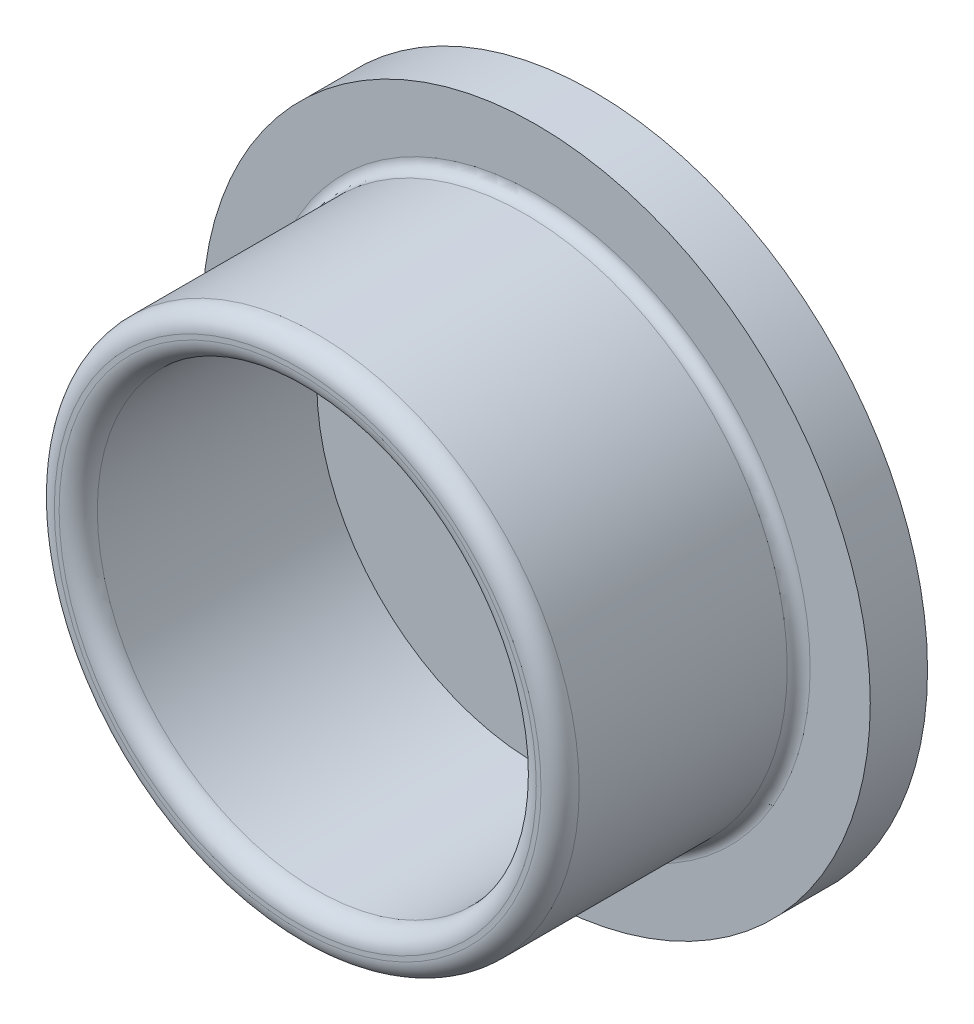
ISO-10303-21;
HEADER;
FILE_DESCRIPTION(('STEP AP214'),'2;1');
FILE_NAME('part.step','',(''),(''),'','','');
FILE_SCHEMA(('AUTOMOTIVE_DESIGN { 1 0 10303 214 1 1 1 1 }'));
ENDSEC;
DATA;
#1=APPLICATION_CONTEXT('core data for automotive mechanical design processes');
#2=APPLICATION_PROTOCOL_DEFINITION('international standard','automotive_design',2000,#1);
#3=PRODUCT_CONTEXT('',#1,'mechanical');
#4=PRODUCT('Part','Part','',(#3));
#5=PRODUCT_RELATED_PRODUCT_CATEGORY('part','',(#4));
#6=PRODUCT_DEFINITION_FORMATION('','',#4);
#7=PRODUCT_DEFINITION_CONTEXT('part definition',#1,'design');
#8=PRODUCT_DEFINITION('design','',#6,#7);
#9=PRODUCT_DEFINITION_SHAPE('','',#8);
#10=(LENGTH_UNIT() NAMED_UNIT(*) SI_UNIT(.MILLI.,.METRE.));
#11=(NAMED_UNIT(*) PLANE_ANGLE_UNIT() SI_UNIT($,.RADIAN.));
#12=(NAMED_UNIT(*) SI_UNIT($,.STERADIAN.) SOLID_ANGLE_UNIT());
#13=UNCERTAINTY_MEASURE_WITH_UNIT(LENGTH_MEASURE(1.E-05),#10,'distance_accuracy_value','');
#14=(GEOMETRIC_REPRESENTATION_CONTEXT(3) GLOBAL_UNCERTAINTY_ASSIGNED_CONTEXT((#13)) GLOBAL_UNIT_ASSIGNED_CONTEXT((#10,
#11,#12)) REPRESENTATION_CONTEXT('',''));
#15=CARTESIAN_POINT('',(0.,0.,0.));
#16=DIRECTION('',(0.,0.,1.));
#17=DIRECTION('',(1.,0.,0.));
#18=AXIS2_PLACEMENT_3D('',#15,#16,#17);
#19=CARTESIAN_POINT('',(0.,0.,3.1));
#20=DIRECTION('',(0.,0.,1.));
#21=DIRECTION('',(1.,0.,0.));
#22=AXIS2_PLACEMENT_3D('',#19,#20,#21);
#23=PLANE('',#22);
#24=CARTESIAN_POINT('',(0.,0.,3.1));
#25=DIRECTION('',(0.,0.,1.));
#26=DIRECTION('',(1.,0.,0.));
#27=AXIS2_PLACEMENT_3D('',#24,#25,#26);
#28=CIRCLE('',#27,2.5);
#29=CARTESIAN_POINT('',(2.5,0.,3.1));
#30=VERTEX_POINT('',#29);
#31=CARTESIAN_POINT('',(-2.5,0.,3.1));
#32=VERTEX_POINT('',#31);
#33=EDGE_CURVE('E59',#30,#32,#28,.T.);
#34=ORIENTED_EDGE('',*,*,#33,.F.);
#35=CARTESIAN_POINT('',(0.,0.,3.1));
#36=DIRECTION('',(0.,0.,1.));
#37=DIRECTION('',(-1.,0.,0.));
#38=AXIS2_PLACEMENT_3D('',#35,#36,#37);
#39=CIRCLE('',#38,2.5);
#40=EDGE_CURVE('E96',#32,#30,#39,.T.);
#41=ORIENTED_EDGE('',*,*,#40,.F.);
#42=EDGE_LOOP('',(#34,#41));
#43=FACE_BOUND('',#42,.T.);
#44=CARTESIAN_POINT('',(0.,0.,3.1));
#45=DIRECTION('',(0.,0.,-1.));
#46=DIRECTION('',(-1.,0.,0.));
#47=AXIS2_PLACEMENT_3D('',#44,#45,#46);
#48=CIRCLE('',#47,2.55);
#49=CARTESIAN_POINT('',(-2.55,0.,3.1));
#50=VERTEX_POINT('',#49);
#51=CARTESIAN_POINT('',(2.55,0.,3.1));
#52=VERTEX_POINT('',#51);
#53=EDGE_CURVE('E51',#50,#52,#48,.T.);
#54=ORIENTED_EDGE('',*,*,#53,.F.);
#55=CARTESIAN_POINT('',(0.,0.,3.1));
#56=DIRECTION('',(0.,0.,-1.));
#57=DIRECTION('',(1.,0.,0.));
#58=AXIS2_PLACEMENT_3D('',#55,#56,#57);
#59=CIRCLE('',#58,2.55);
#60=EDGE_CURVE('E53',#52,#50,#59,.T.);
#61=ORIENTED_EDGE('',*,*,#60,.F.);
#62=EDGE_LOOP('',(#54,#61));
#63=FACE_BOUND('',#62,.T.);
#64=ADVANCED_FACE('F17',(#43,#63),#23,.T.);
#65=CARTESIAN_POINT('',(0.,0.,2.9));
#66=DIRECTION('',(0.,0.,1.));
#67=DIRECTION('',(1.,0.,0.));
#68=AXIS2_PLACEMENT_3D('',#65,#66,#67);
#69=TOROIDAL_SURFACE('',#68,2.55,0.2);
#70=ORIENTED_EDGE('',*,*,#53,.T.);
#71=ORIENTED_EDGE('',*,*,#60,.T.);
#72=EDGE_LOOP('',(#70,#71));
#73=FACE_BOUND('',#72,.T.);
#74=CARTESIAN_POINT('',(0.,0.,2.9));
#75=DIRECTION('',(0.,0.,1.));
#76=DIRECTION('',(1.,0.,0.));
#77=AXIS2_PLACEMENT_3D('',#74,#75,#76);
#78=CIRCLE('',#77,2.75);
#79=CARTESIAN_POINT('',(2.75,0.,2.9));
#80=VERTEX_POINT('',#79);
#81=EDGE_CURVE('E128',#80,#80,#78,.F.);
#82=ORIENTED_EDGE('',*,*,#81,.F.);
#83=EDGE_LOOP('',(#82));
#84=FACE_BOUND('',#83,.T.);
#85=ADVANCED_FACE('F55',(#73,#84),#69,.T.);
#86=CARTESIAN_POINT('',(0.,0.,2.9));
#87=DIRECTION('',(0.,0.,1.));
#88=DIRECTION('',(1.,0.,0.));
#89=AXIS2_PLACEMENT_3D('',#86,#87,#88);
#90=TOROIDAL_SURFACE('',#89,2.5,0.2);
#91=CARTESIAN_POINT('',(0.,0.,2.9));
#92=DIRECTION('',(0.,0.,1.));
#93=DIRECTION('',(1.,0.,0.));
#94=AXIS2_PLACEMENT_3D('',#91,#92,#93);
#95=CIRCLE('',#94,2.3);
#96=CARTESIAN_POINT('',(2.3,0.,2.9));
#97=VERTEX_POINT('',#96);
#98=EDGE_CURVE('E126',#97,#97,#95,.F.);
#99=ORIENTED_EDGE('',*,*,#98,.T.);
#100=EDGE_LOOP('',(#99));
#101=FACE_BOUND('',#100,.T.);
#102=ORIENTED_EDGE('',*,*,#40,.T.);
#103=ORIENTED_EDGE('',*,*,#33,.T.);
#104=EDGE_LOOP('',(#102,#103));
#105=FACE_BOUND('',#104,.T.);
#106=ADVANCED_FACE('F109',(#101,#105),#90,.T.);
#107=CARTESIAN_POINT('',(0.,0.,0.6));
#108=DIRECTION('',(0.,0.,1.));
#109=DIRECTION('',(1.,0.,0.));
#110=AXIS2_PLACEMENT_3D('',#107,#108,#109);
#111=CYLINDRICAL_SURFACE('',#110,2.75);
#112=ORIENTED_EDGE('',*,*,#81,.T.);
#113=EDGE_LOOP('',(#112));
#114=FACE_BOUND('',#113,.T.);
#115=CARTESIAN_POINT('',(0.,0.,0.72));
#116=DIRECTION('',(0.,0.,1.));
#117=DIRECTION('',(1.,0.,0.));
#118=AXIS2_PLACEMENT_3D('',#115,#116,#117);
#119=CIRCLE('',#118,2.75);
#120=CARTESIAN_POINT('',(2.75,0.,0.72));
#121=VERTEX_POINT('',#120);
#122=EDGE_CURVE('E133',#121,#121,#119,.T.);
#123=ORIENTED_EDGE('',*,*,#122,.T.);
#124=EDGE_LOOP('',(#123));
#125=FACE_BOUND('',#124,.T.);
#126=ADVANCED_FACE('F119',(#114,#125),#111,.T.);
#127=CARTESIAN_POINT('',(0.,0.,3.1));
#128=DIRECTION('',(0.,0.,1.));
#129=DIRECTION('',(1.,0.,0.));
#130=AXIS2_PLACEMENT_3D('',#127,#128,#129);
#131=CYLINDRICAL_SURFACE('',#130,2.3);
#132=CARTESIAN_POINT('',(0.,0.,0.6));
#133=DIRECTION('',(0.,0.,1.));
#134=DIRECTION('',(1.,0.,0.));
#135=AXIS2_PLACEMENT_3D('',#132,#133,#134);
#136=CIRCLE('',#135,2.3);
#137=CARTESIAN_POINT('',(2.3,0.,0.6));
#138=VERTEX_POINT('',#137);
#139=EDGE_CURVE('E180',#138,#138,#136,.T.);
#140=ORIENTED_EDGE('',*,*,#139,.F.);
#141=EDGE_LOOP('',(#140));
#142=FACE_BOUND('',#141,.T.);
#143=ORIENTED_EDGE('',*,*,#98,.F.);
#144=EDGE_LOOP('',(#143));
#145=FACE_BOUND('',#144,.T.);
#146=ADVANCED_FACE('F160',(#142,#145),#131,.F.);
#147=CARTESIAN_POINT('',(0.,0.,0.72));
#148=DIRECTION('',(0.,0.,1.));
#149=DIRECTION('',(1.,0.,0.));
#150=AXIS2_PLACEMENT_3D('',#147,#148,#149);
#151=TOROIDAL_SURFACE('',#150,2.87,0.12);
#152=CARTESIAN_POINT('',(0.,0.,0.6));
#153=DIRECTION('',(0.,0.,1.));
#154=DIRECTION('',(-1.,0.,0.));
#155=AXIS2_PLACEMENT_3D('',#152,#153,#154);
#156=CIRCLE('',#155,2.87);
#157=CARTESIAN_POINT('',(2.87,0.,0.6));
#158=VERTEX_POINT('',#157);
#159=CARTESIAN_POINT('',(-2.87,0.,0.6));
#160=VERTEX_POINT('',#159);
#161=EDGE_CURVE('E171',#158,#160,#156,.F.);
#162=ORIENTED_EDGE('',*,*,#161,.F.);
#163=CARTESIAN_POINT('',(0.,0.,0.6));
#164=DIRECTION('',(0.,0.,1.));
#165=DIRECTION('',(1.,0.,0.));
#166=AXIS2_PLACEMENT_3D('',#163,#164,#165);
#167=CIRCLE('',#166,2.87);
#168=EDGE_CURVE('E36',#160,#158,#167,.F.);
#169=ORIENTED_EDGE('',*,*,#168,.F.);
#170=EDGE_LOOP('',(#162,#169));
#171=FACE_BOUND('',#170,.T.);
#172=ORIENTED_EDGE('',*,*,#122,.F.);
#173=EDGE_LOOP('',(#172));
#174=FACE_BOUND('',#173,.T.);
#175=ADVANCED_FACE('F149',(#171,#174),#151,.F.);
#176=CARTESIAN_POINT('',(0.,0.,0.6));
#177=DIRECTION('',(0.,0.,1.));
#178=DIRECTION('',(1.,0.,0.));
#179=AXIS2_PLACEMENT_3D('',#176,#177,#178);
#180=PLANE('',#179);
#181=CARTESIAN_POINT('',(0.,0.,0.6));
#182=DIRECTION('',(0.,0.,-1.));
#183=DIRECTION('',(-1.,0.,0.));
#184=AXIS2_PLACEMENT_3D('',#181,#182,#183);
#185=CIRCLE('',#184,1.);
#186=CARTESIAN_POINT('',(-1.,0.,0.6));
#187=VERTEX_POINT('',#186);
#188=EDGE_CURVE('E187',#187,#187,#185,.T.);
#189=ORIENTED_EDGE('',*,*,#188,.T.);
#190=EDGE_LOOP('',(#189));
#191=FACE_BOUND('',#190,.T.);
#192=ORIENTED_EDGE('',*,*,#139,.T.);
#193=EDGE_LOOP('',(#192));
#194=FACE_BOUND('',#193,.T.);
#195=ADVANCED_FACE('F159',(#191,#194),#180,.T.);
#196=CARTESIAN_POINT('',(0.,0.,0.6));
#197=DIRECTION('',(0.,0.,1.));
#198=DIRECTION('',(1.,0.,0.));
#199=AXIS2_PLACEMENT_3D('',#196,#197,#198);
#200=PLANE('',#199);
#201=ORIENTED_EDGE('',*,*,#168,.T.);
#202=ORIENTED_EDGE('',*,*,#161,.T.);
#203=EDGE_LOOP('',(#201,#202));
#204=FACE_BOUND('',#203,.T.);
#205=CARTESIAN_POINT('',(0.,0.,0.6));
#206=DIRECTION('',(0.,0.,1.));
#207=DIRECTION('',(1.,0.,0.));
#208=AXIS2_PLACEMENT_3D('',#205,#206,#207);
#209=CIRCLE('',#208,3.5);
#210=CARTESIAN_POINT('',(3.5,0.,0.6));
#211=VERTEX_POINT('',#210);
#212=EDGE_CURVE('E190',#211,#211,#209,.F.);
#213=ORIENTED_EDGE('',*,*,#212,.F.);
#214=EDGE_LOOP('',(#213));
#215=FACE_BOUND('',#214,.T.);
#216=ADVANCED_FACE('F219',(#204,#215),#200,.T.);
#217=CARTESIAN_POINT('',(0.,0.,0.));
#218=DIRECTION('',(0.,0.,-1.));
#219=DIRECTION('',(-1.,0.,0.));
#220=AXIS2_PLACEMENT_3D('',#217,#218,#219);
#221=CYLINDRICAL_SURFACE('',#220,1.);
#222=ORIENTED_EDGE('',*,*,#188,.F.);
#223=EDGE_LOOP('',(#222));
#224=FACE_BOUND('',#223,.T.);
#225=CARTESIAN_POINT('',(0.,0.,0.));
#226=DIRECTION('',(0.,0.,-1.));
#227=DIRECTION('',(-1.,0.,0.));
#228=AXIS2_PLACEMENT_3D('',#225,#226,#227);
#229=CIRCLE('',#228,1.);
#230=CARTESIAN_POINT('',(-1.,0.,0.));
#231=VERTEX_POINT('',#230);
#232=EDGE_CURVE('E28',#231,#231,#229,.T.);
#233=ORIENTED_EDGE('',*,*,#232,.T.);
#234=EDGE_LOOP('',(#233));
#235=FACE_BOUND('',#234,.T.);
#236=ADVANCED_FACE('F203',(#224,#235),#221,.F.);
#237=CARTESIAN_POINT('',(0.,0.,0.));
#238=DIRECTION('',(0.,0.,1.));
#239=DIRECTION('',(1.,0.,0.));
#240=AXIS2_PLACEMENT_3D('',#237,#238,#239);
#241=CYLINDRICAL_SURFACE('',#240,3.5);
#242=CARTESIAN_POINT('',(0.,0.,0.));
#243=DIRECTION('',(0.,0.,1.));
#244=DIRECTION('',(1.,0.,0.));
#245=AXIS2_PLACEMENT_3D('',#242,#243,#244);
#246=CIRCLE('',#245,3.5);
#247=CARTESIAN_POINT('',(3.5,0.,0.));
#248=VERTEX_POINT('',#247);
#249=EDGE_CURVE('E11',#248,#248,#246,.T.);
#250=ORIENTED_EDGE('',*,*,#249,.T.);
#251=EDGE_LOOP('',(#250));
#252=FACE_BOUND('',#251,.T.);
#253=ORIENTED_EDGE('',*,*,#212,.T.);
#254=EDGE_LOOP('',(#253));
#255=FACE_BOUND('',#254,.T.);
#256=ADVANCED_FACE('F207',(#252,#255),#241,.T.);
#257=CARTESIAN_POINT('',(0.,0.,0.));
#258=DIRECTION('',(0.,0.,1.));
#259=DIRECTION('',(1.,0.,0.));
#260=AXIS2_PLACEMENT_3D('',#257,#258,#259);
#261=PLANE('',#260);
#262=ORIENTED_EDGE('',*,*,#249,.F.);
#263=EDGE_LOOP('',(#262));
#264=FACE_BOUND('',#263,.T.);
#265=ORIENTED_EDGE('',*,*,#232,.F.);
#266=EDGE_LOOP('',(#265));
#267=FACE_BOUND('',#266,.T.);
#268=ADVANCED_FACE('F205',(#264,#267),#261,.F.);
#269=CLOSED_SHELL('',(#64,#85,#106,#126,#146,#175,#195,#216,#236,#256,#268));
#270=MANIFOLD_SOLID_BREP('B1',#269);
#271=ADVANCED_BREP_SHAPE_REPRESENTATION('',(#18,#270),#14);
#272=SHAPE_DEFINITION_REPRESENTATION(#9,#271);
ENDSEC;
END-ISO-10303-21;
